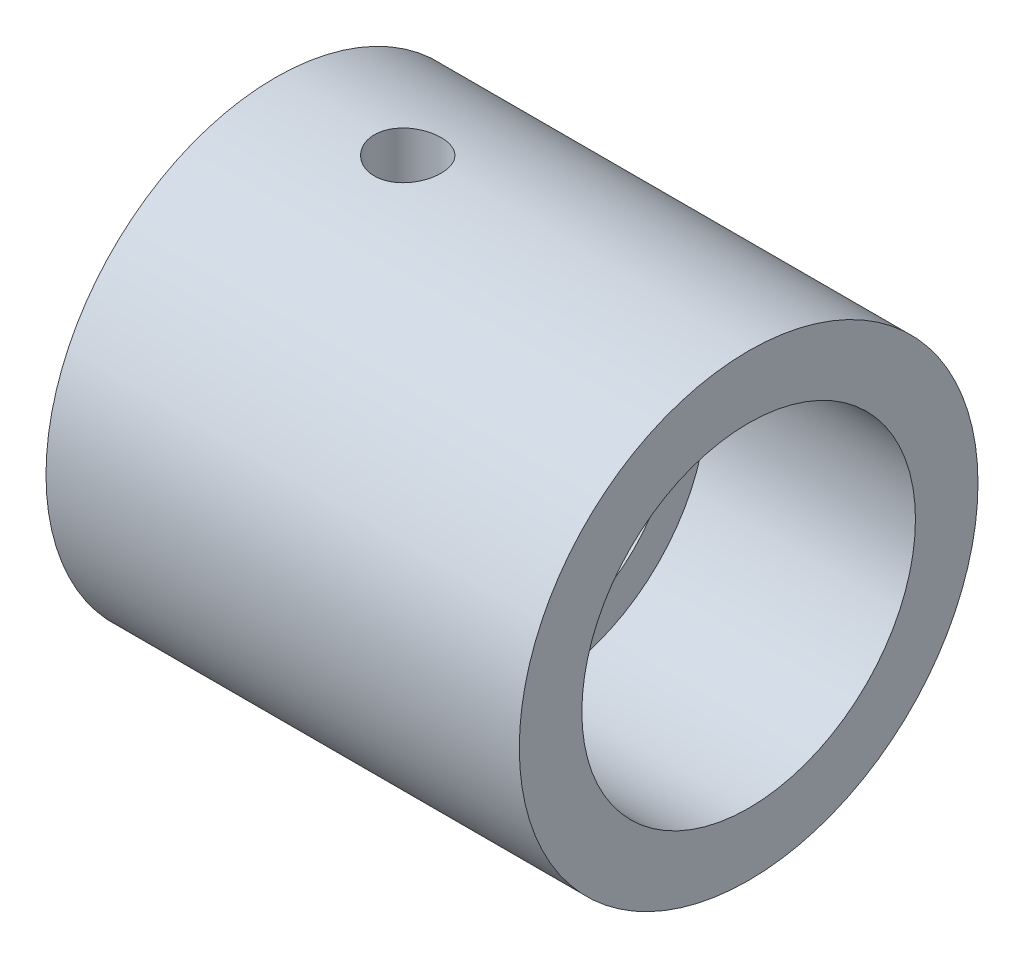
ISO-10303-21;
HEADER;
FILE_DESCRIPTION(('STEP AP214'),'2;1');
FILE_NAME('part.step','',(''),(''),'','','');
FILE_SCHEMA(('AUTOMOTIVE_DESIGN { 1 0 10303 214 1 1 1 1 }'));
ENDSEC;
DATA;
#1=APPLICATION_CONTEXT('core data for automotive mechanical design processes');
#2=APPLICATION_PROTOCOL_DEFINITION('international standard','automotive_design',2000,#1);
#3=PRODUCT_CONTEXT('',#1,'mechanical');
#4=PRODUCT('Part','Part','',(#3));
#5=PRODUCT_RELATED_PRODUCT_CATEGORY('part','',(#4));
#6=PRODUCT_DEFINITION_FORMATION('','',#4);
#7=PRODUCT_DEFINITION_CONTEXT('part definition',#1,'design');
#8=PRODUCT_DEFINITION('design','',#6,#7);
#9=PRODUCT_DEFINITION_SHAPE('','',#8);
#10=(LENGTH_UNIT() NAMED_UNIT(*) SI_UNIT(.MILLI.,.METRE.));
#11=(NAMED_UNIT(*) PLANE_ANGLE_UNIT() SI_UNIT($,.RADIAN.));
#12=(NAMED_UNIT(*) SI_UNIT($,.STERADIAN.) SOLID_ANGLE_UNIT());
#13=UNCERTAINTY_MEASURE_WITH_UNIT(LENGTH_MEASURE(1.E-05),#10,'distance_accuracy_value','');
#14=(GEOMETRIC_REPRESENTATION_CONTEXT(3) GLOBAL_UNCERTAINTY_ASSIGNED_CONTEXT((#13)) GLOBAL_UNIT_ASSIGNED_CONTEXT((#10,
#11,#12)) REPRESENTATION_CONTEXT('',''));
#15=CARTESIAN_POINT('',(0.,0.,0.));
#16=DIRECTION('',(0.,0.,1.));
#17=DIRECTION('',(1.,0.,0.));
#18=AXIS2_PLACEMENT_3D('',#15,#16,#17);
#19=CARTESIAN_POINT('',(0.,0.,0.));
#20=DIRECTION('',(1.,0.,0.));
#21=DIRECTION('',(0.,0.,-1.));
#22=AXIS2_PLACEMENT_3D('',#19,#20,#21);
#23=PLANE('',#22);
#24=CARTESIAN_POINT('',(0.,0.,0.));
#25=DIRECTION('',(1.,0.,0.));
#26=DIRECTION('',(0.,0.,-1.));
#27=AXIS2_PLACEMENT_3D('',#24,#25,#26);
#28=CIRCLE('',#27,3.175);
#29=CARTESIAN_POINT('',(0.,2.625,1.78605710994918));
#30=VERTEX_POINT('',#29);
#31=CARTESIAN_POINT('',(0.,2.625,-1.78605710994918));
#32=VERTEX_POINT('',#31);
#33=EDGE_CURVE('E76',#30,#32,#28,.T.);
#34=ORIENTED_EDGE('',*,*,#33,.F.);
#35=DIRECTION('',(0.,0.,-1.));
#36=VECTOR('',#35,1.);
#37=CARTESIAN_POINT('',(0.,2.625,0.));
#38=LINE('',#37,#36);
#39=EDGE_CURVE('E66',#30,#32,#38,.T.);
#40=ORIENTED_EDGE('',*,*,#39,.T.);
#41=EDGE_LOOP('',(#34,#40));
#42=FACE_BOUND('',#41,.T.);
#43=CARTESIAN_POINT('',(0.,0.,0.));
#44=DIRECTION('',(1.,0.,0.));
#45=DIRECTION('',(0.,0.,-1.));
#46=AXIS2_PLACEMENT_3D('',#43,#44,#45);
#47=CIRCLE('',#46,4.);
#48=CARTESIAN_POINT('',(0.,0.,-4.));
#49=VERTEX_POINT('',#48);
#50=EDGE_CURVE('E89',#49,#49,#47,.T.);
#51=ORIENTED_EDGE('',*,*,#50,.T.);
#52=EDGE_LOOP('',(#51));
#53=FACE_BOUND('',#52,.T.);
#54=ADVANCED_FACE('F34',(#42,#53),#23,.T.);
#55=CARTESIAN_POINT('',(-6.35,0.,0.));
#56=DIRECTION('',(1.,0.,0.));
#57=DIRECTION('',(0.,0.,-1.));
#58=AXIS2_PLACEMENT_3D('',#55,#56,#57);
#59=CYLINDRICAL_SURFACE('',#58,5.5);
#60=CARTESIAN_POINT('',(-3.175,5.44150714416512,0.799999999999994));
#61=CARTESIAN_POINT('',(-3.13031941019635,5.44150787323988,0.799998143061022));
#62=CARTESIAN_POINT('',(-3.08561249474083,5.44206340986617,0.796244181613722));
#63=CARTESIAN_POINT('',(-2.99744749590065,5.44422415653544,0.781330868029708));
#64=CARTESIAN_POINT('',(-2.95399069194758,5.4458304046387,0.770164192270497));
#65=CARTESIAN_POINT('',(-2.86961490628864,5.44990688414653,0.740765632649542));
#66=CARTESIAN_POINT('',(-2.82869404761122,5.45237646734359,0.722539048388189));
#67=CARTESIAN_POINT('',(-2.75049769377432,5.45790058562524,0.679550331201161));
#68=CARTESIAN_POINT('',(-2.71322167428466,5.46095503638582,0.654789140215954));
#69=CARTESIAN_POINT('',(-2.64308611935567,5.4673304703945,0.599234738124417));
#70=CARTESIAN_POINT('',(-2.61025802996828,5.47065311065493,0.568402012738177));
#71=CARTESIAN_POINT('',(-2.55022254460826,5.47717573640762,0.501665058315652));
#72=CARTESIAN_POINT('',(-2.52301545176987,5.48037571527731,0.465760555939664));
#73=CARTESIAN_POINT('',(-2.47487881278525,5.48630974067576,0.38969845495999));
#74=CARTESIAN_POINT('',(-2.45397813634056,5.48904162041506,0.349522402440085));
#75=CARTESIAN_POINT('',(-2.41923281889575,5.49371331099166,0.266183791529203));
#76=CARTESIAN_POINT('',(-2.40538782683526,5.49565316123598,0.223021381847843));
#77=CARTESIAN_POINT('',(-2.38524197077183,5.49851053755592,0.135258779260534));
#78=CARTESIAN_POINT('',(-2.37888850806278,5.49943518823994,0.0906708960651446));
#79=CARTESIAN_POINT('',(-2.37374280013335,5.50018238409444,0.0010529419815892));
#80=CARTESIAN_POINT('',(-2.37495015849615,5.50000498704573,-0.0439771056001296));
#81=CARTESIAN_POINT('',(-2.38485018614221,5.49857378167173,-0.132842485339783));
#82=CARTESIAN_POINT('',(-2.39348627145727,5.49732811051443,-0.176684270845795));
#83=CARTESIAN_POINT('',(-2.41790985892447,5.49390939341991,-0.262289683282976));
#84=CARTESIAN_POINT('',(-2.43369753611893,5.4917363247838,-0.304053259320132));
#85=CARTESIAN_POINT('',(-2.47203451570995,5.48669297606069,-0.384488765422045));
#86=CARTESIAN_POINT('',(-2.49460776830477,5.48382023335213,-0.423149119711552));
#87=CARTESIAN_POINT('',(-2.54585765416898,5.47769794665675,-0.496154524518993));
#88=CARTESIAN_POINT('',(-2.574534665539,5.474448379333,-0.530499307496843));
#89=CARTESIAN_POINT('',(-2.63749358745096,5.46789961627501,-0.594231980601605));
#90=CARTESIAN_POINT('',(-2.67182488450931,5.46460023950848,-0.623571086491203));
#91=CARTESIAN_POINT('',(-2.74494968687057,5.45835310206622,-0.676078981556689));
#92=CARTESIAN_POINT('',(-2.78374321663448,5.45540534331816,-0.699247736905727));
#93=CARTESIAN_POINT('',(-2.86474068400976,5.45019527470979,-0.738763098621209));
#94=CARTESIAN_POINT('',(-2.9069469952885,5.44793344721576,-0.755104907120294));
#95=CARTESIAN_POINT('',(-2.99354533382796,5.44436002798136,-0.780454552444094));
#96=CARTESIAN_POINT('',(-3.03793721647334,5.44304837345975,-0.789462873822763));
#97=CARTESIAN_POINT('',(-3.12721315596081,5.44153564299945,-0.799823375734269));
#98=CARTESIAN_POINT('',(-3.17208903498282,5.44132455024851,-0.801244613302611));
#99=CARTESIAN_POINT('',(-3.26143832217314,5.44201027066158,-0.796573643137155));
#100=CARTESIAN_POINT('',(-3.30591174202164,5.44290705156823,-0.790481654161925));
#101=CARTESIAN_POINT('',(-3.39298110100932,5.4456982855858,-0.771015648381806));
#102=CARTESIAN_POINT('',(-3.4355848531853,5.4475880496037,-0.757675847416326));
#103=CARTESIAN_POINT('',(-3.5179515233898,5.45214846832147,-0.724128404896634));
#104=CARTESIAN_POINT('',(-3.55771430875783,5.45481915945753,-0.703920442883266));
#105=CARTESIAN_POINT('',(-3.63358045016279,5.46066419081446,-0.657043637528298));
#106=CARTESIAN_POINT('',(-3.66965584508388,5.4638419695274,-0.630329977556778));
#107=CARTESIAN_POINT('',(-3.73683614003064,5.47033268224665,-0.571262584591423));
#108=CARTESIAN_POINT('',(-3.76794077611116,5.4736456234183,-0.538908552286841));
#109=CARTESIAN_POINT('',(-3.82454355627415,5.48006458063505,-0.469175175772443));
#110=CARTESIAN_POINT('',(-3.84999600983644,5.48316877824004,-0.431758552482437));
#111=CARTESIAN_POINT('',(-3.89425402025684,5.48879244786549,-0.35314071085898));
#112=CARTESIAN_POINT('',(-3.91305975001336,5.49131193509519,-0.311939591005166));
#113=CARTESIAN_POINT('',(-3.94341700271831,5.49547431993714,-0.227066734921818));
#114=CARTESIAN_POINT('',(-3.95499378348082,5.49712026662322,-0.18340418871259));
#115=CARTESIAN_POINT('',(-3.97064634769837,5.49936289042393,-0.0947291912545556));
#116=CARTESIAN_POINT('',(-3.97472259573408,5.49995963252586,-0.0497168237887855));
#117=CARTESIAN_POINT('',(-3.97524756402458,5.50003602694481,0.039936363096097));
#118=CARTESIAN_POINT('',(-3.97176629774829,5.49952593310712,0.0845767796830897));
#119=CARTESIAN_POINT('',(-3.95742478022673,5.49746658579712,0.172630411593776));
#120=CARTESIAN_POINT('',(-3.946564548564,5.49591733508256,0.216043630173926));
#121=CARTESIAN_POINT('',(-3.91779768223221,5.49195293008481,0.300393233863981));
#122=CARTESIAN_POINT('',(-3.89989560893028,5.48953833641911,0.341331202557083));
#123=CARTESIAN_POINT('',(-3.85756064047758,5.48410887382385,0.419633255230092));
#124=CARTESIAN_POINT('',(-3.83312755891042,5.4810939877606,0.456997237155353));
#125=CARTESIAN_POINT('',(-3.7781697743701,5.4747661309738,0.527446357566402));
#126=CARTESIAN_POINT('',(-3.74759328446624,5.47145076742942,0.560490885312588));
#127=CARTESIAN_POINT('',(-3.68132551415026,5.46491360905749,0.621005719001091));
#128=CARTESIAN_POINT('',(-3.6456330334877,5.461691836401,0.648474713216675));
#129=CARTESIAN_POINT('',(-3.56992634482109,5.45568848179805,0.697187586396474));
#130=CARTESIAN_POINT('',(-3.52989037799965,5.45290930608227,0.718397938048463));
#131=CARTESIAN_POINT('',(-3.44680345748118,5.44813400027189,0.753761986445793));
#132=CARTESIAN_POINT('',(-3.40375571636173,5.44613705036589,0.767923075407299));
#133=CARTESIAN_POINT('',(-3.32959050596552,5.44361829529256,0.78553806252731));
#134=CARTESIAN_POINT('',(-3.29893316110658,5.44283076063127,0.790953090395763));
#135=CARTESIAN_POINT('',(-3.23718812571906,5.4417749343893,0.798184684182331));
#136=CARTESIAN_POINT('',(-3.20610044027069,5.44150663668422,0.8000012925438));
#137=CARTESIAN_POINT('',(-3.175,5.44150714416512,0.799999999999994));
#138=B_SPLINE_CURVE_WITH_KNOTS('',3,(#60,#61,#62,#63,#64,#65,#66,#67,#68,#69,#70,#71,#72,#73,
#74,#75,#76,#77,#78,#79,#80,#81,#82,#83,#84,#85,#86,#87,#88,#89,#90,#91,#92,#93,#94,#95,#96,#97,
#98,#99,#100,#101,#102,#103,#104,#105,#106,#107,#108,#109,#110,#111,#112,#113,#114,#115,#116,
#117,#118,#119,#120,#121,#122,#123,#124,#125,#126,#127,#128,#129,#130,#131,#132,#133,#134,#135,
#136,#137),.UNSPECIFIED.,.T.,.F.,(4,2,2,2,2,2,2,2,2,2,2,2,2,2,2,2,2,2,2,2,2,2,2,2,2,2,2,2,2,2,2,
2,2,2,2,2,2,2,4),(0.,0.133928106179139,0.267988728135715,0.401948910386091,0.535889793286746,
0.670733045334289,0.805583567434733,0.941042359886499,1.07649441183595,1.21098967008447,
1.34547787675291,1.4789506786719,1.61242674764685,1.7463795752916,1.88034070313242,
2.01554083613154,2.15074171030417,2.28603744225792,2.42132423393494,2.55537752982754,
2.68942692265472,2.82284891829535,2.95627714008166,3.09065190383768,3.22503380046687,
3.36046536432086,3.49589340499153,3.63084557533077,3.76578938649321,3.89948840502902,
4.03318706875172,4.16679927113333,4.30041528765268,4.43520884238168,4.57003407262485,
4.705568963854,4.84096142529225,4.93418472907517,5.02740693328276),.UNSPECIFIED.);
#139=CARTESIAN_POINT('',(-3.175,5.44150714416512,0.799999999999994));
#140=VERTEX_POINT('',#139);
#141=EDGE_CURVE('E11',#140,#140,#138,.T.);
#142=ORIENTED_EDGE('',*,*,#141,.F.);
#143=EDGE_LOOP('',(#142));
#144=FACE_BOUND('',#143,.T.);
#145=CARTESIAN_POINT('',(-6.35,0.,0.));
#146=DIRECTION('',(1.,0.,0.));
#147=DIRECTION('',(0.,0.,-1.));
#148=AXIS2_PLACEMENT_3D('',#145,#146,#147);
#149=CIRCLE('',#148,5.5);
#150=CARTESIAN_POINT('',(-6.35,0.,-5.5));
#151=VERTEX_POINT('',#150);
#152=EDGE_CURVE('E80',#151,#151,#149,.T.);
#153=ORIENTED_EDGE('',*,*,#152,.T.);
#154=EDGE_LOOP('',(#153));
#155=FACE_BOUND('',#154,.T.);
#156=CARTESIAN_POINT('',(5.,0.,0.));
#157=DIRECTION('',(1.,0.,0.));
#158=DIRECTION('',(0.,0.,-1.));
#159=AXIS2_PLACEMENT_3D('',#156,#157,#158);
#160=CIRCLE('',#159,5.5);
#161=CARTESIAN_POINT('',(5.,0.,-5.5));
#162=VERTEX_POINT('',#161);
#163=EDGE_CURVE('E81',#162,#162,#160,.T.);
#164=ORIENTED_EDGE('',*,*,#163,.F.);
#165=EDGE_LOOP('',(#164));
#166=FACE_BOUND('',#165,.T.);
#167=ADVANCED_FACE('F36',(#144,#155,#166),#59,.T.);
#168=CARTESIAN_POINT('',(-6.35,0.,0.));
#169=DIRECTION('',(1.,0.,0.));
#170=DIRECTION('',(0.,0.,-1.));
#171=AXIS2_PLACEMENT_3D('',#168,#169,#170);
#172=CYLINDRICAL_SURFACE('',#171,3.175);
#173=ORIENTED_EDGE('',*,*,#33,.T.);
#174=DIRECTION('',(1.,0.,0.));
#175=VECTOR('',#174,1.);
#176=CARTESIAN_POINT('',(-6.35,2.625,-1.78605710994918));
#177=LINE('',#176,#175);
#178=CARTESIAN_POINT('',(-6.35,2.625,-1.78605710994918));
#179=VERTEX_POINT('',#178);
#180=EDGE_CURVE('E63',#179,#32,#177,.T.);
#181=ORIENTED_EDGE('',*,*,#180,.F.);
#182=CARTESIAN_POINT('',(-6.35,0.,0.));
#183=DIRECTION('',(1.,0.,0.));
#184=DIRECTION('',(0.,0.,-1.));
#185=AXIS2_PLACEMENT_3D('',#182,#183,#184);
#186=CIRCLE('',#185,3.175);
#187=CARTESIAN_POINT('',(-6.35,2.625,1.78605710994918));
#188=VERTEX_POINT('',#187);
#189=EDGE_CURVE('E47',#188,#179,#186,.T.);
#190=ORIENTED_EDGE('',*,*,#189,.F.);
#191=DIRECTION('',(1.,0.,0.));
#192=VECTOR('',#191,1.);
#193=CARTESIAN_POINT('',(-6.35,2.625,1.78605710994918));
#194=LINE('',#193,#192);
#195=EDGE_CURVE('E71',#188,#30,#194,.T.);
#196=ORIENTED_EDGE('',*,*,#195,.T.);
#197=EDGE_LOOP('',(#173,#181,#190,#196));
#198=FACE_BOUND('',#197,.T.);
#199=ADVANCED_FACE('F79',(#198),#172,.F.);
#200=CARTESIAN_POINT('',(-6.35,0.,0.));
#201=DIRECTION('',(1.,0.,0.));
#202=DIRECTION('',(0.,0.,-1.));
#203=AXIS2_PLACEMENT_3D('',#200,#201,#202);
#204=PLANE('',#203);
#205=ORIENTED_EDGE('',*,*,#152,.F.);
#206=EDGE_LOOP('',(#205));
#207=FACE_BOUND('',#206,.T.);
#208=ORIENTED_EDGE('',*,*,#189,.T.);
#209=DIRECTION('',(0.,0.,-1.));
#210=VECTOR('',#209,1.);
#211=CARTESIAN_POINT('',(-6.35,2.625,0.));
#212=LINE('',#211,#210);
#213=EDGE_CURVE('E53',#188,#179,#212,.T.);
#214=ORIENTED_EDGE('',*,*,#213,.F.);
#215=EDGE_LOOP('',(#208,#214));
#216=FACE_BOUND('',#215,.T.);
#217=ADVANCED_FACE('F119',(#207,#216),#204,.F.);
#218=CARTESIAN_POINT('',(5.,0.,0.));
#219=DIRECTION('',(-1.,0.,0.));
#220=DIRECTION('',(0.,0.,1.));
#221=AXIS2_PLACEMENT_3D('',#218,#219,#220);
#222=CYLINDRICAL_SURFACE('',#221,4.);
#223=CARTESIAN_POINT('',(5.,0.,0.));
#224=DIRECTION('',(1.,0.,0.));
#225=DIRECTION('',(0.,0.,-1.));
#226=AXIS2_PLACEMENT_3D('',#223,#224,#225);
#227=CIRCLE('',#226,4.);
#228=CARTESIAN_POINT('',(5.,0.,-4.));
#229=VERTEX_POINT('',#228);
#230=EDGE_CURVE('E85',#229,#229,#227,.T.);
#231=ORIENTED_EDGE('',*,*,#230,.T.);
#232=EDGE_LOOP('',(#231));
#233=FACE_BOUND('',#232,.T.);
#234=ORIENTED_EDGE('',*,*,#50,.F.);
#235=EDGE_LOOP('',(#234));
#236=FACE_BOUND('',#235,.T.);
#237=ADVANCED_FACE('F109',(#233,#236),#222,.F.);
#238=CARTESIAN_POINT('',(5.,0.,0.));
#239=DIRECTION('',(1.,0.,0.));
#240=DIRECTION('',(0.,0.,-1.));
#241=AXIS2_PLACEMENT_3D('',#238,#239,#240);
#242=PLANE('',#241);
#243=ORIENTED_EDGE('',*,*,#230,.F.);
#244=EDGE_LOOP('',(#243));
#245=FACE_BOUND('',#244,.T.);
#246=ORIENTED_EDGE('',*,*,#163,.T.);
#247=EDGE_LOOP('',(#246));
#248=FACE_BOUND('',#247,.T.);
#249=ADVANCED_FACE('F103',(#245,#248),#242,.T.);
#250=CARTESIAN_POINT('',(-6.35,2.625,0.));
#251=DIRECTION('',(0.,-1.,0.));
#252=DIRECTION('',(0.,0.,-1.));
#253=AXIS2_PLACEMENT_3D('',#250,#251,#252);
#254=PLANE('',#253);
#255=CARTESIAN_POINT('',(-3.175,2.625,0.));
#256=DIRECTION('',(0.,-1.,0.));
#257=DIRECTION('',(0.,0.,-1.));
#258=AXIS2_PLACEMENT_3D('',#255,#256,#257);
#259=CIRCLE('',#258,0.799999999999994);
#260=CARTESIAN_POINT('',(-3.175,2.625,-0.799999999999994));
#261=VERTEX_POINT('',#260);
#262=EDGE_CURVE('E77',#261,#261,#259,.T.);
#263=ORIENTED_EDGE('',*,*,#262,.F.);
#264=EDGE_LOOP('',(#263));
#265=FACE_BOUND('',#264,.T.);
#266=ORIENTED_EDGE('',*,*,#39,.F.);
#267=ORIENTED_EDGE('',*,*,#195,.F.);
#268=ORIENTED_EDGE('',*,*,#213,.T.);
#269=ORIENTED_EDGE('',*,*,#180,.T.);
#270=EDGE_LOOP('',(#266,#267,#268,#269));
#271=FACE_BOUND('',#270,.T.);
#272=ADVANCED_FACE('F65',(#265,#271),#254,.T.);
#273=CARTESIAN_POINT('',(-3.175,5.5,0.));
#274=DIRECTION('',(0.,1.,0.));
#275=DIRECTION('',(0.,0.,1.));
#276=AXIS2_PLACEMENT_3D('',#273,#274,#275);
#277=CYLINDRICAL_SURFACE('',#276,0.799999999999994);
#278=ORIENTED_EDGE('',*,*,#262,.T.);
#279=EDGE_LOOP('',(#278));
#280=FACE_BOUND('',#279,.T.);
#281=ORIENTED_EDGE('',*,*,#141,.T.);
#282=EDGE_LOOP('',(#281));
#283=FACE_BOUND('',#282,.T.);
#284=ADVANCED_FACE('F99',(#280,#283),#277,.F.);
#285=CLOSED_SHELL('',(#54,#167,#199,#217,#237,#249,#272,#284));
#286=MANIFOLD_SOLID_BREP('B2',#285);
#287=ADVANCED_BREP_SHAPE_REPRESENTATION('',(#18,#286),#14);
#288=SHAPE_DEFINITION_REPRESENTATION(#9,#287);
ENDSEC;
END-ISO-10303-21;
